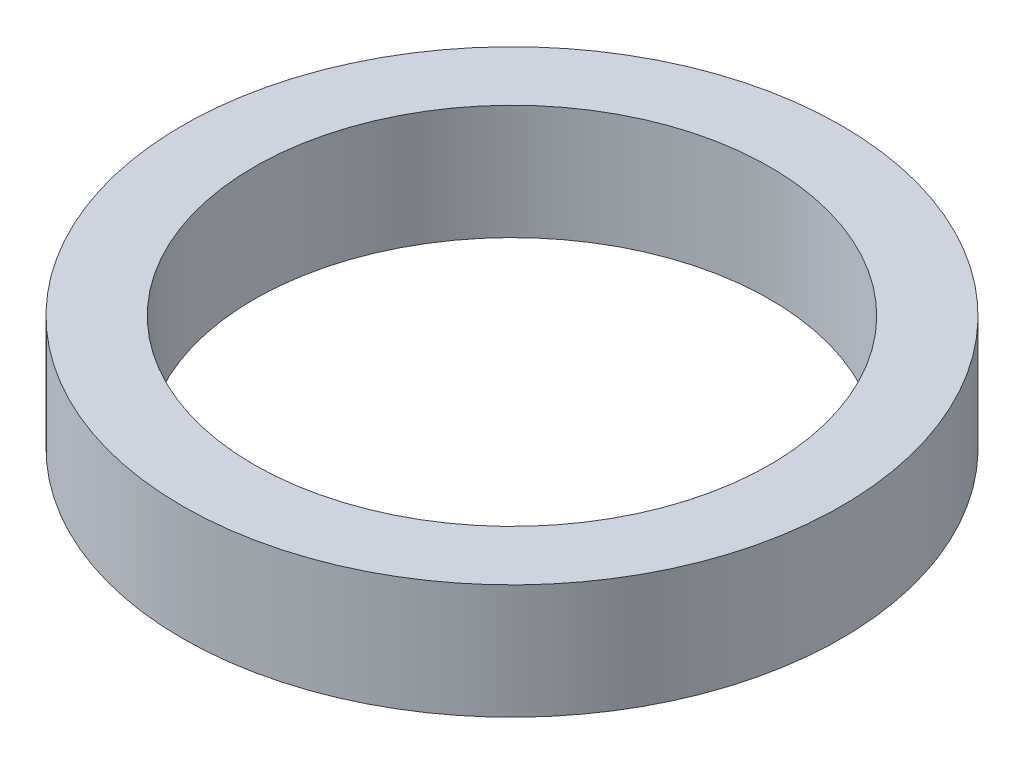
ISO-10303-21;
HEADER;
FILE_DESCRIPTION(('STEP AP214'),'2;1');
FILE_NAME('part.step','',(''),(''),'','','');
FILE_SCHEMA(('AUTOMOTIVE_DESIGN { 1 0 10303 214 1 1 1 1 }'));
ENDSEC;
DATA;
#1=APPLICATION_CONTEXT('core data for automotive mechanical design processes');
#2=APPLICATION_PROTOCOL_DEFINITION('international standard','automotive_design',2000,#1);
#3=PRODUCT_CONTEXT('',#1,'mechanical');
#4=PRODUCT('Part','Part','',(#3));
#5=PRODUCT_RELATED_PRODUCT_CATEGORY('part','',(#4));
#6=PRODUCT_DEFINITION_FORMATION('','',#4);
#7=PRODUCT_DEFINITION_CONTEXT('part definition',#1,'design');
#8=PRODUCT_DEFINITION('design','',#6,#7);
#9=PRODUCT_DEFINITION_SHAPE('','',#8);
#10=(LENGTH_UNIT() NAMED_UNIT(*) SI_UNIT(.MILLI.,.METRE.));
#11=(NAMED_UNIT(*) PLANE_ANGLE_UNIT() SI_UNIT($,.RADIAN.));
#12=(NAMED_UNIT(*) SI_UNIT($,.STERADIAN.) SOLID_ANGLE_UNIT());
#13=UNCERTAINTY_MEASURE_WITH_UNIT(LENGTH_MEASURE(1.E-05),#10,'distance_accuracy_value','');
#14=(GEOMETRIC_REPRESENTATION_CONTEXT(3) GLOBAL_UNCERTAINTY_ASSIGNED_CONTEXT((#13)) GLOBAL_UNIT_ASSIGNED_CONTEXT((#10,
#11,#12)) REPRESENTATION_CONTEXT('',''));
#15=CARTESIAN_POINT('',(0.,0.,0.));
#16=DIRECTION('',(0.,0.,1.));
#17=DIRECTION('',(1.,0.,0.));
#18=AXIS2_PLACEMENT_3D('',#15,#16,#17);
#19=CARTESIAN_POINT('',(0.,20.,0.));
#20=DIRECTION('',(0.,-1.,0.));
#21=DIRECTION('',(0.,0.,-1.));
#22=AXIS2_PLACEMENT_3D('',#19,#20,#21);
#23=CYLINDRICAL_SURFACE('',#22,57.5);
#24=CARTESIAN_POINT('',(0.,20.,0.));
#25=DIRECTION('',(0.,1.,0.));
#26=DIRECTION('',(0.,0.,1.));
#27=AXIS2_PLACEMENT_3D('',#24,#25,#26);
#28=CIRCLE('',#27,57.5);
#29=CARTESIAN_POINT('',(0.,20.,57.5));
#30=VERTEX_POINT('',#29);
#31=EDGE_CURVE('E10',#30,#30,#28,.T.);
#32=ORIENTED_EDGE('',*,*,#31,.F.);
#33=EDGE_LOOP('',(#32));
#34=FACE_BOUND('',#33,.T.);
#35=CARTESIAN_POINT('',(0.,0.,0.));
#36=DIRECTION('',(0.,1.,0.));
#37=DIRECTION('',(0.,0.,1.));
#38=AXIS2_PLACEMENT_3D('',#35,#36,#37);
#39=CIRCLE('',#38,57.5);
#40=CARTESIAN_POINT('',(0.,0.,57.5));
#41=VERTEX_POINT('',#40);
#42=EDGE_CURVE('E37',#41,#41,#39,.T.);
#43=ORIENTED_EDGE('',*,*,#42,.T.);
#44=EDGE_LOOP('',(#43));
#45=FACE_BOUND('',#44,.T.);
#46=ADVANCED_FACE('F40',(#34,#45),#23,.T.);
#47=CARTESIAN_POINT('',(0.,20.,0.));
#48=DIRECTION('',(0.,1.,0.));
#49=DIRECTION('',(0.,0.,1.));
#50=AXIS2_PLACEMENT_3D('',#47,#48,#49);
#51=PLANE('',#50);
#52=CARTESIAN_POINT('',(0.,20.,0.));
#53=DIRECTION('',(0.,1.,0.));
#54=DIRECTION('',(0.,0.,1.));
#55=AXIS2_PLACEMENT_3D('',#52,#53,#54);
#56=CIRCLE('',#55,45.);
#57=CARTESIAN_POINT('',(0.,20.,45.));
#58=VERTEX_POINT('',#57);
#59=EDGE_CURVE('E50',#58,#58,#56,.T.);
#60=ORIENTED_EDGE('',*,*,#59,.F.);
#61=EDGE_LOOP('',(#60));
#62=FACE_BOUND('',#61,.T.);
#63=ORIENTED_EDGE('',*,*,#31,.T.);
#64=EDGE_LOOP('',(#63));
#65=FACE_BOUND('',#64,.T.);
#66=ADVANCED_FACE('F59',(#62,#65),#51,.T.);
#67=CARTESIAN_POINT('',(0.,0.,0.));
#68=DIRECTION('',(0.,1.,0.));
#69=DIRECTION('',(0.,0.,1.));
#70=AXIS2_PLACEMENT_3D('',#67,#68,#69);
#71=PLANE('',#70);
#72=CARTESIAN_POINT('',(0.,0.,0.));
#73=DIRECTION('',(0.,1.,0.));
#74=DIRECTION('',(0.,0.,1.));
#75=AXIS2_PLACEMENT_3D('',#72,#73,#74);
#76=CIRCLE('',#75,45.);
#77=CARTESIAN_POINT('',(0.,0.,45.));
#78=VERTEX_POINT('',#77);
#79=EDGE_CURVE('E47',#78,#78,#76,.T.);
#80=ORIENTED_EDGE('',*,*,#79,.T.);
#81=EDGE_LOOP('',(#80));
#82=FACE_BOUND('',#81,.T.);
#83=ORIENTED_EDGE('',*,*,#42,.F.);
#84=EDGE_LOOP('',(#83));
#85=FACE_BOUND('',#84,.T.);
#86=ADVANCED_FACE('F58',(#82,#85),#71,.F.);
#87=CARTESIAN_POINT('',(0.,20.,0.));
#88=DIRECTION('',(0.,-1.,0.));
#89=DIRECTION('',(0.,0.,-1.));
#90=AXIS2_PLACEMENT_3D('',#87,#88,#89);
#91=CYLINDRICAL_SURFACE('',#90,45.);
#92=ORIENTED_EDGE('',*,*,#59,.T.);
#93=EDGE_LOOP('',(#92));
#94=FACE_BOUND('',#93,.T.);
#95=ORIENTED_EDGE('',*,*,#79,.F.);
#96=EDGE_LOOP('',(#95));
#97=FACE_BOUND('',#96,.T.);
#98=ADVANCED_FACE('F54',(#94,#97),#91,.F.);
#99=CLOSED_SHELL('',(#46,#66,#86,#98));
#100=MANIFOLD_SOLID_BREP('B2',#99);
#101=ADVANCED_BREP_SHAPE_REPRESENTATION('',(#18,#100),#14);
#102=SHAPE_DEFINITION_REPRESENTATION(#9,#101);
ENDSEC;
END-ISO-10303-21;
